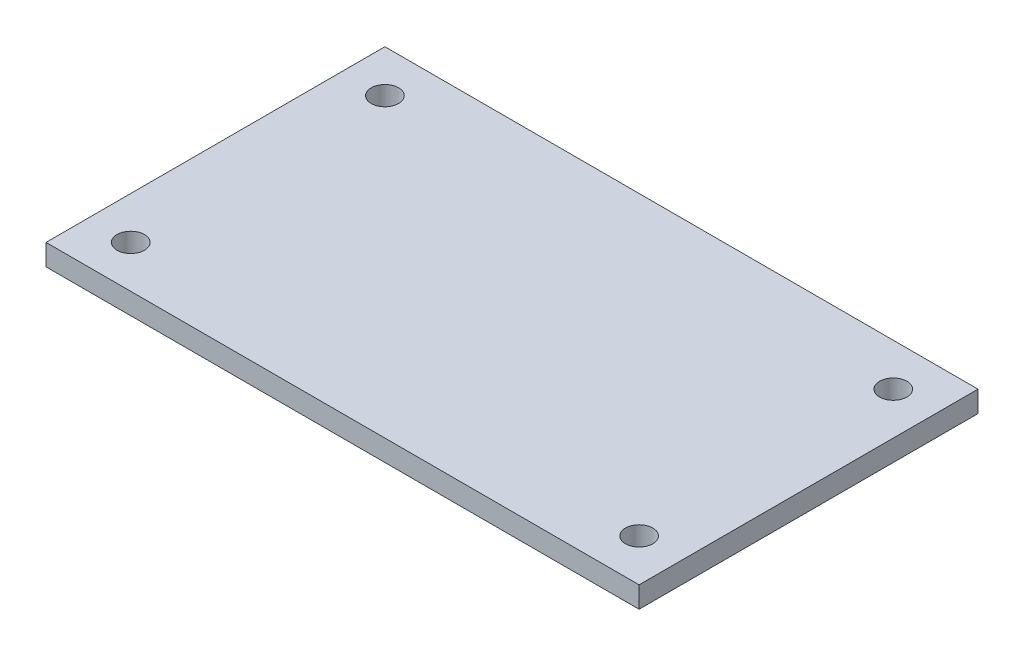
ISO-10303-21;
HEADER;
FILE_DESCRIPTION(('STEP AP214'),'2;1');
FILE_NAME('part.step','',(''),(''),'','','');
FILE_SCHEMA(('AUTOMOTIVE_DESIGN { 1 0 10303 214 1 1 1 1 }'));
ENDSEC;
DATA;
#1=APPLICATION_CONTEXT('core data for automotive mechanical design processes');
#2=APPLICATION_PROTOCOL_DEFINITION('international standard','automotive_design',2000,#1);
#3=PRODUCT_CONTEXT('',#1,'mechanical');
#4=PRODUCT('Part','Part','',(#3));
#5=PRODUCT_RELATED_PRODUCT_CATEGORY('part','',(#4));
#6=PRODUCT_DEFINITION_FORMATION('','',#4);
#7=PRODUCT_DEFINITION_CONTEXT('part definition',#1,'design');
#8=PRODUCT_DEFINITION('design','',#6,#7);
#9=PRODUCT_DEFINITION_SHAPE('','',#8);
#10=(LENGTH_UNIT() NAMED_UNIT(*) SI_UNIT(.MILLI.,.METRE.));
#11=(NAMED_UNIT(*) PLANE_ANGLE_UNIT() SI_UNIT($,.RADIAN.));
#12=(NAMED_UNIT(*) SI_UNIT($,.STERADIAN.) SOLID_ANGLE_UNIT());
#13=UNCERTAINTY_MEASURE_WITH_UNIT(LENGTH_MEASURE(1.E-05),#10,'distance_accuracy_value','');
#14=(GEOMETRIC_REPRESENTATION_CONTEXT(3) GLOBAL_UNCERTAINTY_ASSIGNED_CONTEXT((#13)) GLOBAL_UNIT_ASSIGNED_CONTEXT((#10,
#11,#12)) REPRESENTATION_CONTEXT('',''));
#15=CARTESIAN_POINT('',(0.,0.,0.));
#16=DIRECTION('',(0.,0.,1.));
#17=DIRECTION('',(1.,0.,0.));
#18=AXIS2_PLACEMENT_3D('',#15,#16,#17);
#19=CARTESIAN_POINT('',(88.9,-6.35,50.8));
#20=DIRECTION('',(1.,0.,0.));
#21=DIRECTION('',(0.,0.,-1.));
#22=AXIS2_PLACEMENT_3D('',#19,#20,#21);
#23=PLANE('',#22);
#24=DIRECTION('',(0.,0.,-1.));
#25=VECTOR('',#24,1.);
#26=CARTESIAN_POINT('',(88.9,0.,50.8));
#27=LINE('',#26,#25);
#28=CARTESIAN_POINT('',(88.9,0.,50.8));
#29=VERTEX_POINT('',#28);
#30=CARTESIAN_POINT('',(88.9,0.,-50.8));
#31=VERTEX_POINT('',#30);
#32=EDGE_CURVE('E99',#29,#31,#27,.T.);
#33=ORIENTED_EDGE('',*,*,#32,.F.);
#34=DIRECTION('',(0.,1.,0.));
#35=VECTOR('',#34,1.);
#36=CARTESIAN_POINT('',(88.9,-6.35,50.8));
#37=LINE('',#36,#35);
#38=CARTESIAN_POINT('',(88.9,-6.35,50.8));
#39=VERTEX_POINT('',#38);
#40=EDGE_CURVE('E11',#39,#29,#37,.T.);
#41=ORIENTED_EDGE('',*,*,#40,.F.);
#42=DIRECTION('',(0.,0.,-1.));
#43=VECTOR('',#42,1.);
#44=CARTESIAN_POINT('',(88.9,-6.35,50.8));
#45=LINE('',#44,#43);
#46=CARTESIAN_POINT('',(88.9,-6.35,-50.8));
#47=VERTEX_POINT('',#46);
#48=EDGE_CURVE('E92',#39,#47,#45,.T.);
#49=ORIENTED_EDGE('',*,*,#48,.T.);
#50=DIRECTION('',(0.,1.,0.));
#51=VECTOR('',#50,1.);
#52=CARTESIAN_POINT('',(88.9,-6.35,-50.8));
#53=LINE('',#52,#51);
#54=EDGE_CURVE('E37',#47,#31,#53,.T.);
#55=ORIENTED_EDGE('',*,*,#54,.T.);
#56=EDGE_LOOP('',(#33,#41,#49,#55));
#57=FACE_BOUND('',#56,.T.);
#58=ADVANCED_FACE('F34',(#57),#23,.T.);
#59=CARTESIAN_POINT('',(-88.9,-6.35,50.8));
#60=DIRECTION('',(0.,0.,1.));
#61=DIRECTION('',(1.,0.,0.));
#62=AXIS2_PLACEMENT_3D('',#59,#60,#61);
#63=PLANE('',#62);
#64=DIRECTION('',(1.,0.,0.));
#65=VECTOR('',#64,1.);
#66=CARTESIAN_POINT('',(-88.9,0.,50.8));
#67=LINE('',#66,#65);
#68=CARTESIAN_POINT('',(-88.9,0.,50.8));
#69=VERTEX_POINT('',#68);
#70=EDGE_CURVE('E94',#69,#29,#67,.T.);
#71=ORIENTED_EDGE('',*,*,#70,.F.);
#72=DIRECTION('',(0.,1.,0.));
#73=VECTOR('',#72,1.);
#74=CARTESIAN_POINT('',(-88.9,-6.35,50.8));
#75=LINE('',#74,#73);
#76=CARTESIAN_POINT('',(-88.9,-6.35,50.8));
#77=VERTEX_POINT('',#76);
#78=EDGE_CURVE('E43',#77,#69,#75,.T.);
#79=ORIENTED_EDGE('',*,*,#78,.F.);
#80=DIRECTION('',(1.,0.,0.));
#81=VECTOR('',#80,1.);
#82=CARTESIAN_POINT('',(-88.9,-6.35,50.8));
#83=LINE('',#82,#81);
#84=EDGE_CURVE('E89',#77,#39,#83,.T.);
#85=ORIENTED_EDGE('',*,*,#84,.T.);
#86=ORIENTED_EDGE('',*,*,#40,.T.);
#87=EDGE_LOOP('',(#71,#79,#85,#86));
#88=FACE_BOUND('',#87,.T.);
#89=ADVANCED_FACE('F110',(#88),#63,.T.);
#90=CARTESIAN_POINT('',(-88.9,-6.35,50.8));
#91=DIRECTION('',(-1.,0.,0.));
#92=DIRECTION('',(0.,0.,1.));
#93=AXIS2_PLACEMENT_3D('',#90,#91,#92);
#94=PLANE('',#93);
#95=DIRECTION('',(0.,0.,1.));
#96=VECTOR('',#95,1.);
#97=CARTESIAN_POINT('',(-88.9,0.,50.8));
#98=LINE('',#97,#96);
#99=CARTESIAN_POINT('',(-88.9,0.,-50.8));
#100=VERTEX_POINT('',#99);
#101=EDGE_CURVE('E84',#100,#69,#98,.T.);
#102=ORIENTED_EDGE('',*,*,#101,.F.);
#103=DIRECTION('',(0.,1.,0.));
#104=VECTOR('',#103,1.);
#105=CARTESIAN_POINT('',(-88.9,-6.35,-50.8));
#106=LINE('',#105,#104);
#107=CARTESIAN_POINT('',(-88.9,-6.35,-50.8));
#108=VERTEX_POINT('',#107);
#109=EDGE_CURVE('E79',#108,#100,#106,.T.);
#110=ORIENTED_EDGE('',*,*,#109,.F.);
#111=DIRECTION('',(0.,0.,1.));
#112=VECTOR('',#111,1.);
#113=CARTESIAN_POINT('',(-88.9,-6.35,50.8));
#114=LINE('',#113,#112);
#115=EDGE_CURVE('E82',#108,#77,#114,.T.);
#116=ORIENTED_EDGE('',*,*,#115,.T.);
#117=ORIENTED_EDGE('',*,*,#78,.T.);
#118=EDGE_LOOP('',(#102,#110,#116,#117));
#119=FACE_BOUND('',#118,.T.);
#120=ADVANCED_FACE('F81',(#119),#94,.T.);
#121=CARTESIAN_POINT('',(-88.9,-6.35,-50.8));
#122=DIRECTION('',(0.,0.,-1.));
#123=DIRECTION('',(-1.,0.,0.));
#124=AXIS2_PLACEMENT_3D('',#121,#122,#123);
#125=PLANE('',#124);
#126=DIRECTION('',(-1.,0.,0.));
#127=VECTOR('',#126,1.);
#128=CARTESIAN_POINT('',(-88.9,0.,-50.8));
#129=LINE('',#128,#127);
#130=EDGE_CURVE('E102',#31,#100,#129,.T.);
#131=ORIENTED_EDGE('',*,*,#130,.F.);
#132=ORIENTED_EDGE('',*,*,#54,.F.);
#133=DIRECTION('',(-1.,0.,0.));
#134=VECTOR('',#133,1.);
#135=CARTESIAN_POINT('',(-88.9,-6.35,-50.8));
#136=LINE('',#135,#134);
#137=EDGE_CURVE('E88',#47,#108,#136,.T.);
#138=ORIENTED_EDGE('',*,*,#137,.T.);
#139=ORIENTED_EDGE('',*,*,#109,.T.);
#140=EDGE_LOOP('',(#131,#132,#138,#139));
#141=FACE_BOUND('',#140,.T.);
#142=ADVANCED_FACE('F91',(#141),#125,.T.);
#143=CARTESIAN_POINT('',(0.,-6.35,0.));
#144=DIRECTION('',(0.,-1.,0.));
#145=DIRECTION('',(0.,0.,-1.));
#146=AXIS2_PLACEMENT_3D('',#143,#144,#145);
#147=PLANE('',#146);
#148=CARTESIAN_POINT('',(-76.2,-6.35,-38.1));
#149=DIRECTION('',(0.,1.,0.));
#150=DIRECTION('',(0.,0.,1.));
#151=AXIS2_PLACEMENT_3D('',#148,#149,#150);
#152=CIRCLE('',#151,4.1021);
#153=CARTESIAN_POINT('',(-76.2,-6.35,-33.9979));
#154=VERTEX_POINT('',#153);
#155=EDGE_CURVE('E151',#154,#154,#152,.T.);
#156=ORIENTED_EDGE('',*,*,#155,.T.);
#157=EDGE_LOOP('',(#156));
#158=FACE_BOUND('',#157,.T.);
#159=CARTESIAN_POINT('',(-76.2,-6.35,38.1));
#160=DIRECTION('',(0.,1.,0.));
#161=DIRECTION('',(0.,0.,1.));
#162=AXIS2_PLACEMENT_3D('',#159,#160,#161);
#163=CIRCLE('',#162,4.1021);
#164=CARTESIAN_POINT('',(-76.2,-6.35,42.2021));
#165=VERTEX_POINT('',#164);
#166=EDGE_CURVE('E161',#165,#165,#163,.T.);
#167=ORIENTED_EDGE('',*,*,#166,.T.);
#168=EDGE_LOOP('',(#167));
#169=FACE_BOUND('',#168,.T.);
#170=CARTESIAN_POINT('',(76.2,-6.35,38.1));
#171=DIRECTION('',(0.,1.,0.));
#172=DIRECTION('',(0.,0.,1.));
#173=AXIS2_PLACEMENT_3D('',#170,#171,#172);
#174=CIRCLE('',#173,4.1021);
#175=CARTESIAN_POINT('',(76.2,-6.35,42.2021));
#176=VERTEX_POINT('',#175);
#177=EDGE_CURVE('E167',#176,#176,#174,.T.);
#178=ORIENTED_EDGE('',*,*,#177,.T.);
#179=EDGE_LOOP('',(#178));
#180=FACE_BOUND('',#179,.T.);
#181=CARTESIAN_POINT('',(76.2,-6.35,-38.1));
#182=DIRECTION('',(0.,1.,0.));
#183=DIRECTION('',(0.,0.,1.));
#184=AXIS2_PLACEMENT_3D('',#181,#182,#183);
#185=CIRCLE('',#184,4.1021);
#186=CARTESIAN_POINT('',(76.2,-6.35,-33.9979));
#187=VERTEX_POINT('',#186);
#188=EDGE_CURVE('E103',#187,#187,#185,.T.);
#189=ORIENTED_EDGE('',*,*,#188,.T.);
#190=EDGE_LOOP('',(#189));
#191=FACE_BOUND('',#190,.T.);
#192=ORIENTED_EDGE('',*,*,#48,.F.);
#193=ORIENTED_EDGE('',*,*,#84,.F.);
#194=ORIENTED_EDGE('',*,*,#115,.F.);
#195=ORIENTED_EDGE('',*,*,#137,.F.);
#196=EDGE_LOOP('',(#192,#193,#194,#195));
#197=FACE_BOUND('',#196,.T.);
#198=ADVANCED_FACE('F87',(#158,#169,#180,#191,#197),#147,.T.);
#199=CARTESIAN_POINT('',(0.,0.,0.));
#200=DIRECTION('',(0.,-1.,0.));
#201=DIRECTION('',(0.,0.,-1.));
#202=AXIS2_PLACEMENT_3D('',#199,#200,#201);
#203=PLANE('',#202);
#204=CARTESIAN_POINT('',(-76.2,0.,-38.1));
#205=DIRECTION('',(0.,1.,0.));
#206=DIRECTION('',(0.,0.,1.));
#207=AXIS2_PLACEMENT_3D('',#204,#205,#206);
#208=CIRCLE('',#207,4.1021);
#209=CARTESIAN_POINT('',(-76.2,0.,-33.9979));
#210=VERTEX_POINT('',#209);
#211=EDGE_CURVE('E154',#210,#210,#208,.T.);
#212=ORIENTED_EDGE('',*,*,#211,.F.);
#213=EDGE_LOOP('',(#212));
#214=FACE_BOUND('',#213,.T.);
#215=CARTESIAN_POINT('',(-76.2,0.,38.1));
#216=DIRECTION('',(0.,1.,0.));
#217=DIRECTION('',(0.,0.,1.));
#218=AXIS2_PLACEMENT_3D('',#215,#216,#217);
#219=CIRCLE('',#218,4.1021);
#220=CARTESIAN_POINT('',(-76.2,0.,42.2021));
#221=VERTEX_POINT('',#220);
#222=EDGE_CURVE('E156',#221,#221,#219,.T.);
#223=ORIENTED_EDGE('',*,*,#222,.F.);
#224=EDGE_LOOP('',(#223));
#225=FACE_BOUND('',#224,.T.);
#226=CARTESIAN_POINT('',(76.2,0.,38.1));
#227=DIRECTION('',(0.,1.,0.));
#228=DIRECTION('',(0.,0.,1.));
#229=AXIS2_PLACEMENT_3D('',#226,#227,#228);
#230=CIRCLE('',#229,4.1021);
#231=CARTESIAN_POINT('',(76.2,0.,42.2021));
#232=VERTEX_POINT('',#231);
#233=EDGE_CURVE('E164',#232,#232,#230,.T.);
#234=ORIENTED_EDGE('',*,*,#233,.F.);
#235=EDGE_LOOP('',(#234));
#236=FACE_BOUND('',#235,.T.);
#237=CARTESIAN_POINT('',(76.2,0.,-38.1));
#238=DIRECTION('',(0.,1.,0.));
#239=DIRECTION('',(0.,0.,1.));
#240=AXIS2_PLACEMENT_3D('',#237,#238,#239);
#241=CIRCLE('',#240,4.1021);
#242=CARTESIAN_POINT('',(76.2,0.,-33.9979));
#243=VERTEX_POINT('',#242);
#244=EDGE_CURVE('E170',#243,#243,#241,.T.);
#245=ORIENTED_EDGE('',*,*,#244,.F.);
#246=EDGE_LOOP('',(#245));
#247=FACE_BOUND('',#246,.T.);
#248=ORIENTED_EDGE('',*,*,#32,.T.);
#249=ORIENTED_EDGE('',*,*,#130,.T.);
#250=ORIENTED_EDGE('',*,*,#101,.T.);
#251=ORIENTED_EDGE('',*,*,#70,.T.);
#252=EDGE_LOOP('',(#248,#249,#250,#251));
#253=FACE_BOUND('',#252,.T.);
#254=ADVANCED_FACE('F109',(#214,#225,#236,#247,#253),#203,.F.);
#255=CARTESIAN_POINT('',(76.2,0.,-38.1));
#256=DIRECTION('',(0.,1.,0.));
#257=DIRECTION('',(0.,0.,1.));
#258=AXIS2_PLACEMENT_3D('',#255,#256,#257);
#259=CYLINDRICAL_SURFACE('',#258,4.1021);
#260=ORIENTED_EDGE('',*,*,#188,.F.);
#261=EDGE_LOOP('',(#260));
#262=FACE_BOUND('',#261,.T.);
#263=ORIENTED_EDGE('',*,*,#244,.T.);
#264=EDGE_LOOP('',(#263));
#265=FACE_BOUND('',#264,.T.);
#266=ADVANCED_FACE('F128',(#262,#265),#259,.F.);
#267=CARTESIAN_POINT('',(76.2,0.,38.1));
#268=DIRECTION('',(0.,1.,0.));
#269=DIRECTION('',(0.,0.,1.));
#270=AXIS2_PLACEMENT_3D('',#267,#268,#269);
#271=CYLINDRICAL_SURFACE('',#270,4.1021);
#272=ORIENTED_EDGE('',*,*,#177,.F.);
#273=EDGE_LOOP('',(#272));
#274=FACE_BOUND('',#273,.T.);
#275=ORIENTED_EDGE('',*,*,#233,.T.);
#276=EDGE_LOOP('',(#275));
#277=FACE_BOUND('',#276,.T.);
#278=ADVANCED_FACE('F135',(#274,#277),#271,.F.);
#279=CARTESIAN_POINT('',(-76.2,0.,38.1));
#280=DIRECTION('',(0.,1.,0.));
#281=DIRECTION('',(0.,0.,1.));
#282=AXIS2_PLACEMENT_3D('',#279,#280,#281);
#283=CYLINDRICAL_SURFACE('',#282,4.1021);
#284=ORIENTED_EDGE('',*,*,#166,.F.);
#285=EDGE_LOOP('',(#284));
#286=FACE_BOUND('',#285,.T.);
#287=ORIENTED_EDGE('',*,*,#222,.T.);
#288=EDGE_LOOP('',(#287));
#289=FACE_BOUND('',#288,.T.);
#290=ADVANCED_FACE('F139',(#286,#289),#283,.F.);
#291=CARTESIAN_POINT('',(-76.2,0.,-38.1));
#292=DIRECTION('',(0.,1.,0.));
#293=DIRECTION('',(0.,0.,1.));
#294=AXIS2_PLACEMENT_3D('',#291,#292,#293);
#295=CYLINDRICAL_SURFACE('',#294,4.1021);
#296=ORIENTED_EDGE('',*,*,#155,.F.);
#297=EDGE_LOOP('',(#296));
#298=FACE_BOUND('',#297,.T.);
#299=ORIENTED_EDGE('',*,*,#211,.T.);
#300=EDGE_LOOP('',(#299));
#301=FACE_BOUND('',#300,.T.);
#302=ADVANCED_FACE('F143',(#298,#301),#295,.F.);
#303=CLOSED_SHELL('',(#58,#89,#120,#142,#198,#254,#266,#278,#290,#302));
#304=MANIFOLD_SOLID_BREP('B2',#303);
#305=ADVANCED_BREP_SHAPE_REPRESENTATION('',(#18,#304),#14);
#306=SHAPE_DEFINITION_REPRESENTATION(#9,#305);
ENDSEC;
END-ISO-10303-21;
